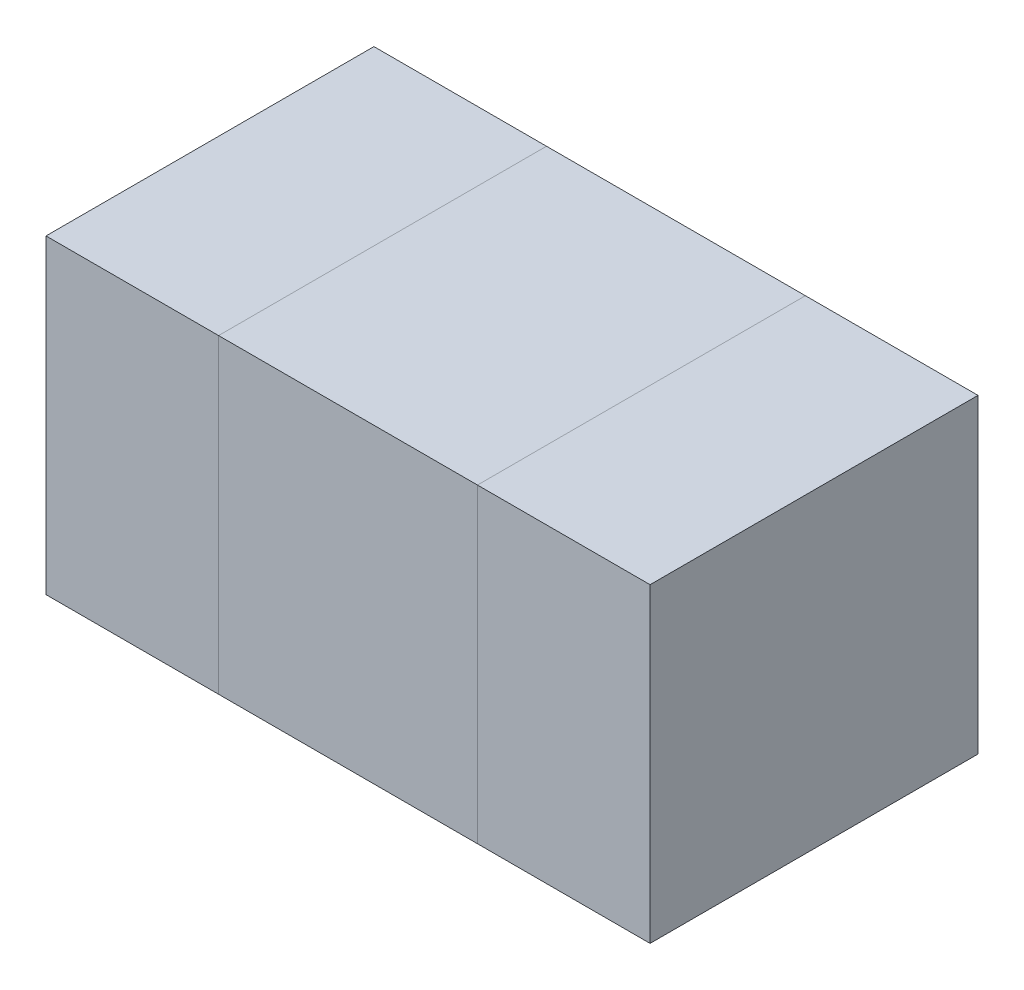
ISO-10303-21;
HEADER;
FILE_DESCRIPTION(('STEP AP214'),'2;1');
FILE_NAME('part.step','',(''),(''),'','','');
FILE_SCHEMA(('AUTOMOTIVE_DESIGN { 1 0 10303 214 1 1 1 1 }'));
ENDSEC;
DATA;
#1=APPLICATION_CONTEXT('core data for automotive mechanical design processes');
#2=APPLICATION_PROTOCOL_DEFINITION('international standard','automotive_design',2000,#1);
#3=PRODUCT_CONTEXT('',#1,'mechanical');
#4=PRODUCT('Part','Part','',(#3));
#5=PRODUCT_RELATED_PRODUCT_CATEGORY('part','',(#4));
#6=PRODUCT_DEFINITION_FORMATION('','',#4);
#7=PRODUCT_DEFINITION_CONTEXT('part definition',#1,'design');
#8=PRODUCT_DEFINITION('design','',#6,#7);
#9=PRODUCT_DEFINITION_SHAPE('','',#8);
#10=(LENGTH_UNIT() NAMED_UNIT(*) SI_UNIT(.MILLI.,.METRE.));
#11=(NAMED_UNIT(*) PLANE_ANGLE_UNIT() SI_UNIT($,.RADIAN.));
#12=(NAMED_UNIT(*) SI_UNIT($,.STERADIAN.) SOLID_ANGLE_UNIT());
#13=UNCERTAINTY_MEASURE_WITH_UNIT(LENGTH_MEASURE(1.E-05),#10,'distance_accuracy_value','');
#14=(GEOMETRIC_REPRESENTATION_CONTEXT(3) GLOBAL_UNCERTAINTY_ASSIGNED_CONTEXT((#13)) GLOBAL_UNIT_ASSIGNED_CONTEXT((#10,
#11,#12)) REPRESENTATION_CONTEXT('',''));
#15=CARTESIAN_POINT('',(0.,0.,0.));
#16=DIRECTION('',(0.,0.,1.));
#17=DIRECTION('',(1.,0.,0.));
#18=AXIS2_PLACEMENT_3D('',#15,#16,#17);
#19=CARTESIAN_POINT('',(-0.875,0.9,-0.475));
#20=DIRECTION('',(1.,0.,0.));
#21=DIRECTION('',(0.,0.,-1.));
#22=AXIS2_PLACEMENT_3D('',#19,#20,#21);
#23=PLANE('',#22);
#24=DIRECTION('',(0.,0.,-1.));
#25=VECTOR('',#24,1.);
#26=CARTESIAN_POINT('',(-0.875,0.9,0.475));
#27=LINE('',#26,#25);
#28=CARTESIAN_POINT('',(-0.875,0.9,0.475));
#29=VERTEX_POINT('',#28);
#30=CARTESIAN_POINT('',(-0.875,0.9,-0.475));
#31=VERTEX_POINT('',#30);
#32=EDGE_CURVE('P0_E76',#29,#31,#27,.T.);
#33=ORIENTED_EDGE('',*,*,#32,.T.);
#34=DIRECTION('',(0.,1.,0.));
#35=VECTOR('',#34,1.);
#36=CARTESIAN_POINT('',(-0.875,0.9,-0.475));
#37=LINE('',#36,#35);
#38=CARTESIAN_POINT('',(-0.875,0.,-0.475));
#39=VERTEX_POINT('',#38);
#40=EDGE_CURVE('P0_E58',#31,#39,#37,.F.);
#41=ORIENTED_EDGE('',*,*,#40,.T.);
#42=DIRECTION('',(0.,0.,-1.));
#43=VECTOR('',#42,1.);
#44=CARTESIAN_POINT('',(-0.875,0.,0.475));
#45=LINE('',#44,#43);
#46=CARTESIAN_POINT('',(-0.875,0.,0.475));
#47=VERTEX_POINT('',#46);
#48=EDGE_CURVE('P0_E20',#47,#39,#45,.T.);
#49=ORIENTED_EDGE('',*,*,#48,.F.);
#50=DIRECTION('',(0.,1.,0.));
#51=VECTOR('',#50,1.);
#52=CARTESIAN_POINT('',(-0.875,0.9,0.475));
#53=LINE('',#52,#51);
#54=EDGE_CURVE('P0_E55',#47,#29,#53,.T.);
#55=ORIENTED_EDGE('',*,*,#54,.T.);
#56=EDGE_LOOP('',(#33,#41,#49,#55));
#57=FACE_BOUND('',#56,.T.);
#58=ADVANCED_FACE('P0_F17',(#57),#23,.F.);
#59=CARTESIAN_POINT('',(-0.375,0.,0.475));
#60=DIRECTION('',(0.,-1.,0.));
#61=DIRECTION('',(0.,0.,-1.));
#62=AXIS2_PLACEMENT_3D('',#59,#60,#61);
#63=PLANE('',#62);
#64=DIRECTION('',(0.,0.,1.));
#65=VECTOR('',#64,1.);
#66=CARTESIAN_POINT('',(-0.375,0.,-0.475));
#67=LINE('',#66,#65);
#68=CARTESIAN_POINT('',(-0.375,0.,-0.475));
#69=VERTEX_POINT('',#68);
#70=CARTESIAN_POINT('',(-0.375,0.,0.475));
#71=VERTEX_POINT('',#70);
#72=EDGE_CURVE('P0_E73',#69,#71,#67,.T.);
#73=ORIENTED_EDGE('',*,*,#72,.T.);
#74=DIRECTION('',(-1.,0.,0.));
#75=VECTOR('',#74,1.);
#76=CARTESIAN_POINT('',(-0.375,0.,0.475));
#77=LINE('',#76,#75);
#78=EDGE_CURVE('P0_E63',#71,#47,#77,.T.);
#79=ORIENTED_EDGE('',*,*,#78,.T.);
#80=ORIENTED_EDGE('',*,*,#48,.T.);
#81=DIRECTION('',(1.,0.,0.));
#82=VECTOR('',#81,1.);
#83=CARTESIAN_POINT('',(-0.375,0.,-0.475));
#84=LINE('',#83,#82);
#85=EDGE_CURVE('P0_E78',#39,#69,#84,.T.);
#86=ORIENTED_EDGE('',*,*,#85,.T.);
#87=EDGE_LOOP('',(#73,#79,#80,#86));
#88=FACE_BOUND('',#87,.T.);
#89=ADVANCED_FACE('P0_F72',(#88),#63,.T.);
#90=CARTESIAN_POINT('',(-0.375,0.9,0.475));
#91=DIRECTION('',(0.,0.,-1.));
#92=DIRECTION('',(-1.,0.,0.));
#93=AXIS2_PLACEMENT_3D('',#90,#91,#92);
#94=PLANE('',#93);
#95=DIRECTION('',(1.,0.,0.));
#96=VECTOR('',#95,1.);
#97=CARTESIAN_POINT('',(-0.375,0.9,0.475));
#98=LINE('',#97,#96);
#99=CARTESIAN_POINT('',(-0.375,0.9,0.475));
#100=VERTEX_POINT('',#99);
#101=EDGE_CURVE('P0_E69',#100,#29,#98,.F.);
#102=ORIENTED_EDGE('',*,*,#101,.T.);
#103=ORIENTED_EDGE('',*,*,#54,.F.);
#104=ORIENTED_EDGE('',*,*,#78,.F.);
#105=DIRECTION('',(0.,1.,0.));
#106=VECTOR('',#105,1.);
#107=CARTESIAN_POINT('',(-0.375,0.9,0.475));
#108=LINE('',#107,#106);
#109=EDGE_CURVE('P0_E83',#71,#100,#108,.T.);
#110=ORIENTED_EDGE('',*,*,#109,.T.);
#111=EDGE_LOOP('',(#102,#103,#104,#110));
#112=FACE_BOUND('',#111,.T.);
#113=ADVANCED_FACE('P0_F66',(#112),#94,.F.);
#114=CARTESIAN_POINT('',(-0.375,0.9,0.475));
#115=DIRECTION('',(0.,-1.,0.));
#116=DIRECTION('',(0.,0.,-1.));
#117=AXIS2_PLACEMENT_3D('',#114,#115,#116);
#118=PLANE('',#117);
#119=ORIENTED_EDGE('',*,*,#32,.F.);
#120=ORIENTED_EDGE('',*,*,#101,.F.);
#121=DIRECTION('',(0.,0.,1.));
#122=VECTOR('',#121,1.);
#123=CARTESIAN_POINT('',(-0.375,0.9,-0.475));
#124=LINE('',#123,#122);
#125=CARTESIAN_POINT('',(-0.375,0.9,-0.475));
#126=VERTEX_POINT('',#125);
#127=EDGE_CURVE('P0_E26',#100,#126,#124,.F.);
#128=ORIENTED_EDGE('',*,*,#127,.T.);
#129=DIRECTION('',(1.,0.,0.));
#130=VECTOR('',#129,1.);
#131=CARTESIAN_POINT('',(-0.375,0.9,-0.475));
#132=LINE('',#131,#130);
#133=EDGE_CURVE('P0_E34',#126,#31,#132,.F.);
#134=ORIENTED_EDGE('',*,*,#133,.T.);
#135=EDGE_LOOP('',(#119,#120,#128,#134));
#136=FACE_BOUND('',#135,.T.);
#137=ADVANCED_FACE('P0_F88',(#136),#118,.F.);
#138=CARTESIAN_POINT('',(-0.375,0.9,-0.475));
#139=DIRECTION('',(0.,0.,1.));
#140=DIRECTION('',(1.,0.,0.));
#141=AXIS2_PLACEMENT_3D('',#138,#139,#140);
#142=PLANE('',#141);
#143=ORIENTED_EDGE('',*,*,#133,.F.);
#144=DIRECTION('',(0.,1.,0.));
#145=VECTOR('',#144,1.);
#146=CARTESIAN_POINT('',(-0.375,0.9,-0.475));
#147=LINE('',#146,#145);
#148=EDGE_CURVE('P0_E11',#126,#69,#147,.F.);
#149=ORIENTED_EDGE('',*,*,#148,.T.);
#150=ORIENTED_EDGE('',*,*,#85,.F.);
#151=ORIENTED_EDGE('',*,*,#40,.F.);
#152=EDGE_LOOP('',(#143,#149,#150,#151));
#153=FACE_BOUND('',#152,.T.);
#154=ADVANCED_FACE('P0_F91',(#153),#142,.F.);
#155=CARTESIAN_POINT('',(-0.375,0.9,-0.475));
#156=DIRECTION('',(-1.,0.,0.));
#157=DIRECTION('',(0.,0.,1.));
#158=AXIS2_PLACEMENT_3D('',#155,#156,#157);
#159=PLANE('',#158);
#160=ORIENTED_EDGE('',*,*,#127,.F.);
#161=ORIENTED_EDGE('',*,*,#109,.F.);
#162=ORIENTED_EDGE('',*,*,#72,.F.);
#163=ORIENTED_EDGE('',*,*,#148,.F.);
#164=EDGE_LOOP('',(#160,#161,#162,#163));
#165=FACE_BOUND('',#164,.T.);
#166=ADVANCED_FACE('P0_F90',(#165),#159,.F.);
#167=CLOSED_SHELL('',(#58,#89,#113,#137,#154,#166));
#168=MANIFOLD_SOLID_BREP('P0_B1',#167);
#169=CARTESIAN_POINT('',(0.875,0.9,-0.475));
#170=DIRECTION('',(-1.,0.,0.));
#171=DIRECTION('',(0.,0.,1.));
#172=AXIS2_PLACEMENT_3D('',#169,#170,#171);
#173=PLANE('',#172);
#174=DIRECTION('',(0.,0.,-1.));
#175=VECTOR('',#174,1.);
#176=CARTESIAN_POINT('',(0.875,0.9,-0.475));
#177=LINE('',#176,#175);
#178=CARTESIAN_POINT('',(0.875,0.9,-0.475));
#179=VERTEX_POINT('',#178);
#180=CARTESIAN_POINT('',(0.875,0.9,0.475));
#181=VERTEX_POINT('',#180);
#182=EDGE_CURVE('P1_E76',#179,#181,#177,.F.);
#183=ORIENTED_EDGE('',*,*,#182,.T.);
#184=DIRECTION('',(0.,1.,0.));
#185=VECTOR('',#184,1.);
#186=CARTESIAN_POINT('',(0.875,0.9,0.475));
#187=LINE('',#186,#185);
#188=CARTESIAN_POINT('',(0.875,0.,0.475));
#189=VERTEX_POINT('',#188);
#190=EDGE_CURVE('P1_E58',#181,#189,#187,.F.);
#191=ORIENTED_EDGE('',*,*,#190,.T.);
#192=DIRECTION('',(0.,0.,-1.));
#193=VECTOR('',#192,1.);
#194=CARTESIAN_POINT('',(0.875,0.,-0.475));
#195=LINE('',#194,#193);
#196=CARTESIAN_POINT('',(0.875,0.,-0.475));
#197=VERTEX_POINT('',#196);
#198=EDGE_CURVE('P1_E20',#197,#189,#195,.F.);
#199=ORIENTED_EDGE('',*,*,#198,.F.);
#200=DIRECTION('',(0.,1.,0.));
#201=VECTOR('',#200,1.);
#202=CARTESIAN_POINT('',(0.875,0.9,-0.475));
#203=LINE('',#202,#201);
#204=EDGE_CURVE('P1_E55',#197,#179,#203,.T.);
#205=ORIENTED_EDGE('',*,*,#204,.T.);
#206=EDGE_LOOP('',(#183,#191,#199,#205));
#207=FACE_BOUND('',#206,.T.);
#208=ADVANCED_FACE('P1_F17',(#207),#173,.F.);
#209=CARTESIAN_POINT('',(0.875,0.,-0.475));
#210=DIRECTION('',(0.,-1.,0.));
#211=DIRECTION('',(0.,0.,-1.));
#212=AXIS2_PLACEMENT_3D('',#209,#210,#211);
#213=PLANE('',#212);
#214=DIRECTION('',(1.,0.,0.));
#215=VECTOR('',#214,1.);
#216=CARTESIAN_POINT('',(0.375,0.,-0.475));
#217=LINE('',#216,#215);
#218=CARTESIAN_POINT('',(0.375,0.,-0.475));
#219=VERTEX_POINT('',#218);
#220=EDGE_CURVE('P1_E63',#219,#197,#217,.T.);
#221=ORIENTED_EDGE('',*,*,#220,.T.);
#222=ORIENTED_EDGE('',*,*,#198,.T.);
#223=DIRECTION('',(-1.,0.,0.));
#224=VECTOR('',#223,1.);
#225=CARTESIAN_POINT('',(0.375,0.,0.475));
#226=LINE('',#225,#224);
#227=CARTESIAN_POINT('',(0.375,0.,0.475));
#228=VERTEX_POINT('',#227);
#229=EDGE_CURVE('P1_E78',#189,#228,#226,.T.);
#230=ORIENTED_EDGE('',*,*,#229,.T.);
#231=DIRECTION('',(0.,0.,-1.));
#232=VECTOR('',#231,1.);
#233=CARTESIAN_POINT('',(0.375,0.,-0.475));
#234=LINE('',#233,#232);
#235=EDGE_CURVE('P1_E73',#228,#219,#234,.T.);
#236=ORIENTED_EDGE('',*,*,#235,.T.);
#237=EDGE_LOOP('',(#221,#222,#230,#236));
#238=FACE_BOUND('',#237,.T.);
#239=ADVANCED_FACE('P1_F72',(#238),#213,.T.);
#240=CARTESIAN_POINT('',(0.375,0.9,-0.475));
#241=DIRECTION('',(0.,0.,1.));
#242=DIRECTION('',(1.,0.,0.));
#243=AXIS2_PLACEMENT_3D('',#240,#241,#242);
#244=PLANE('',#243);
#245=DIRECTION('',(1.,0.,0.));
#246=VECTOR('',#245,1.);
#247=CARTESIAN_POINT('',(0.875,0.9,-0.475));
#248=LINE('',#247,#246);
#249=CARTESIAN_POINT('',(0.375,0.9,-0.475));
#250=VERTEX_POINT('',#249);
#251=EDGE_CURVE('P1_E69',#250,#179,#248,.T.);
#252=ORIENTED_EDGE('',*,*,#251,.T.);
#253=ORIENTED_EDGE('',*,*,#204,.F.);
#254=ORIENTED_EDGE('',*,*,#220,.F.);
#255=DIRECTION('',(0.,1.,0.));
#256=VECTOR('',#255,1.);
#257=CARTESIAN_POINT('',(0.375,0.9,-0.475));
#258=LINE('',#257,#256);
#259=EDGE_CURVE('P1_E83',#219,#250,#258,.T.);
#260=ORIENTED_EDGE('',*,*,#259,.T.);
#261=EDGE_LOOP('',(#252,#253,#254,#260));
#262=FACE_BOUND('',#261,.T.);
#263=ADVANCED_FACE('P1_F66',(#262),#244,.F.);
#264=CARTESIAN_POINT('',(0.875,0.9,-0.475));
#265=DIRECTION('',(0.,-1.,0.));
#266=DIRECTION('',(0.,0.,-1.));
#267=AXIS2_PLACEMENT_3D('',#264,#265,#266);
#268=PLANE('',#267);
#269=DIRECTION('',(-1.,0.,0.));
#270=VECTOR('',#269,1.);
#271=CARTESIAN_POINT('',(0.375,0.9,0.475));
#272=LINE('',#271,#270);
#273=CARTESIAN_POINT('',(0.375,0.9,0.475));
#274=VERTEX_POINT('',#273);
#275=EDGE_CURVE('P1_E34',#274,#181,#272,.F.);
#276=ORIENTED_EDGE('',*,*,#275,.T.);
#277=ORIENTED_EDGE('',*,*,#182,.F.);
#278=ORIENTED_EDGE('',*,*,#251,.F.);
#279=DIRECTION('',(0.,0.,-1.));
#280=VECTOR('',#279,1.);
#281=CARTESIAN_POINT('',(0.375,0.9,-0.475));
#282=LINE('',#281,#280);
#283=EDGE_CURVE('P1_E26',#250,#274,#282,.F.);
#284=ORIENTED_EDGE('',*,*,#283,.T.);
#285=EDGE_LOOP('',(#276,#277,#278,#284));
#286=FACE_BOUND('',#285,.T.);
#287=ADVANCED_FACE('P1_F88',(#286),#268,.F.);
#288=CARTESIAN_POINT('',(0.375,0.9,0.475));
#289=DIRECTION('',(0.,0.,-1.));
#290=DIRECTION('',(-1.,0.,0.));
#291=AXIS2_PLACEMENT_3D('',#288,#289,#290);
#292=PLANE('',#291);
#293=ORIENTED_EDGE('',*,*,#275,.F.);
#294=DIRECTION('',(0.,1.,0.));
#295=VECTOR('',#294,1.);
#296=CARTESIAN_POINT('',(0.375,0.9,0.475));
#297=LINE('',#296,#295);
#298=EDGE_CURVE('P1_E11',#274,#228,#297,.F.);
#299=ORIENTED_EDGE('',*,*,#298,.T.);
#300=ORIENTED_EDGE('',*,*,#229,.F.);
#301=ORIENTED_EDGE('',*,*,#190,.F.);
#302=EDGE_LOOP('',(#293,#299,#300,#301));
#303=FACE_BOUND('',#302,.T.);
#304=ADVANCED_FACE('P1_F91',(#303),#292,.F.);
#305=CARTESIAN_POINT('',(0.375,0.9,-0.475));
#306=DIRECTION('',(1.,0.,0.));
#307=DIRECTION('',(0.,0.,-1.));
#308=AXIS2_PLACEMENT_3D('',#305,#306,#307);
#309=PLANE('',#308);
#310=ORIENTED_EDGE('',*,*,#283,.F.);
#311=ORIENTED_EDGE('',*,*,#259,.F.);
#312=ORIENTED_EDGE('',*,*,#235,.F.);
#313=ORIENTED_EDGE('',*,*,#298,.F.);
#314=EDGE_LOOP('',(#310,#311,#312,#313));
#315=FACE_BOUND('',#314,.T.);
#316=ADVANCED_FACE('P1_F90',(#315),#309,.F.);
#317=CLOSED_SHELL('',(#208,#239,#263,#287,#304,#316));
#318=MANIFOLD_SOLID_BREP('P1_B1',#317);
#319=CARTESIAN_POINT('',(-0.375,0.9,0.475));
#320=DIRECTION('',(1.,0.,0.));
#321=DIRECTION('',(0.,0.,-1.));
#322=AXIS2_PLACEMENT_3D('',#319,#320,#321);
#323=PLANE('',#322);
#324=DIRECTION('',(0.,0.,-1.));
#325=VECTOR('',#324,1.);
#326=CARTESIAN_POINT('',(-0.375,0.9,-0.475));
#327=LINE('',#326,#325);
#328=CARTESIAN_POINT('',(-0.375,0.9,0.475));
#329=VERTEX_POINT('',#328);
#330=CARTESIAN_POINT('',(-0.375,0.9,-0.475));
#331=VERTEX_POINT('',#330);
#332=EDGE_CURVE('P2_E76',#329,#331,#327,.T.);
#333=ORIENTED_EDGE('',*,*,#332,.T.);
#334=DIRECTION('',(0.,1.,0.));
#335=VECTOR('',#334,1.);
#336=CARTESIAN_POINT('',(-0.375,0.9,-0.475));
#337=LINE('',#336,#335);
#338=CARTESIAN_POINT('',(-0.375,0.,-0.475));
#339=VERTEX_POINT('',#338);
#340=EDGE_CURVE('P2_E58',#331,#339,#337,.F.);
#341=ORIENTED_EDGE('',*,*,#340,.T.);
#342=DIRECTION('',(0.,0.,-1.));
#343=VECTOR('',#342,1.);
#344=CARTESIAN_POINT('',(-0.375,0.,-0.475));
#345=LINE('',#344,#343);
#346=CARTESIAN_POINT('',(-0.375,0.,0.475));
#347=VERTEX_POINT('',#346);
#348=EDGE_CURVE('P2_E20',#347,#339,#345,.T.);
#349=ORIENTED_EDGE('',*,*,#348,.F.);
#350=DIRECTION('',(0.,1.,0.));
#351=VECTOR('',#350,1.);
#352=CARTESIAN_POINT('',(-0.375,0.9,0.475));
#353=LINE('',#352,#351);
#354=EDGE_CURVE('P2_E55',#347,#329,#353,.T.);
#355=ORIENTED_EDGE('',*,*,#354,.T.);
#356=EDGE_LOOP('',(#333,#341,#349,#355));
#357=FACE_BOUND('',#356,.T.);
#358=ADVANCED_FACE('P2_F17',(#357),#323,.F.);
#359=CARTESIAN_POINT('',(0.375,0.,-0.475));
#360=DIRECTION('',(0.,-1.,0.));
#361=DIRECTION('',(0.,0.,-1.));
#362=AXIS2_PLACEMENT_3D('',#359,#360,#361);
#363=PLANE('',#362);
#364=DIRECTION('',(0.,0.,1.));
#365=VECTOR('',#364,1.);
#366=CARTESIAN_POINT('',(0.375,0.,0.475));
#367=LINE('',#366,#365);
#368=CARTESIAN_POINT('',(0.375,0.,-0.475));
#369=VERTEX_POINT('',#368);
#370=CARTESIAN_POINT('',(0.375,0.,0.475));
#371=VERTEX_POINT('',#370);
#372=EDGE_CURVE('P2_E73',#369,#371,#367,.T.);
#373=ORIENTED_EDGE('',*,*,#372,.T.);
#374=DIRECTION('',(-1.,0.,0.));
#375=VECTOR('',#374,1.);
#376=CARTESIAN_POINT('',(-0.375,0.,0.475));
#377=LINE('',#376,#375);
#378=EDGE_CURVE('P2_E63',#371,#347,#377,.T.);
#379=ORIENTED_EDGE('',*,*,#378,.T.);
#380=ORIENTED_EDGE('',*,*,#348,.T.);
#381=DIRECTION('',(1.,0.,0.));
#382=VECTOR('',#381,1.);
#383=CARTESIAN_POINT('',(-0.375,0.,-0.475));
#384=LINE('',#383,#382);
#385=EDGE_CURVE('P2_E78',#339,#369,#384,.T.);
#386=ORIENTED_EDGE('',*,*,#385,.T.);
#387=EDGE_LOOP('',(#373,#379,#380,#386));
#388=FACE_BOUND('',#387,.T.);
#389=ADVANCED_FACE('P2_F72',(#388),#363,.T.);
#390=CARTESIAN_POINT('',(-0.375,0.9,0.475));
#391=DIRECTION('',(0.,0.,-1.));
#392=DIRECTION('',(-1.,0.,0.));
#393=AXIS2_PLACEMENT_3D('',#390,#391,#392);
#394=PLANE('',#393);
#395=DIRECTION('',(1.,0.,0.));
#396=VECTOR('',#395,1.);
#397=CARTESIAN_POINT('',(0.375,0.9,0.475));
#398=LINE('',#397,#396);
#399=CARTESIAN_POINT('',(0.375,0.9,0.475));
#400=VERTEX_POINT('',#399);
#401=EDGE_CURVE('P2_E69',#400,#329,#398,.F.);
#402=ORIENTED_EDGE('',*,*,#401,.T.);
#403=ORIENTED_EDGE('',*,*,#354,.F.);
#404=ORIENTED_EDGE('',*,*,#378,.F.);
#405=DIRECTION('',(0.,1.,0.));
#406=VECTOR('',#405,1.);
#407=CARTESIAN_POINT('',(0.375,0.9,0.475));
#408=LINE('',#407,#406);
#409=EDGE_CURVE('P2_E83',#371,#400,#408,.T.);
#410=ORIENTED_EDGE('',*,*,#409,.T.);
#411=EDGE_LOOP('',(#402,#403,#404,#410));
#412=FACE_BOUND('',#411,.T.);
#413=ADVANCED_FACE('P2_F66',(#412),#394,.F.);
#414=CARTESIAN_POINT('',(0.375,0.9,-0.475));
#415=DIRECTION('',(0.,-1.,0.));
#416=DIRECTION('',(0.,0.,-1.));
#417=AXIS2_PLACEMENT_3D('',#414,#415,#416);
#418=PLANE('',#417);
#419=ORIENTED_EDGE('',*,*,#332,.F.);
#420=ORIENTED_EDGE('',*,*,#401,.F.);
#421=DIRECTION('',(0.,0.,1.));
#422=VECTOR('',#421,1.);
#423=CARTESIAN_POINT('',(0.375,0.9,0.475));
#424=LINE('',#423,#422);
#425=CARTESIAN_POINT('',(0.375,0.9,-0.475));
#426=VERTEX_POINT('',#425);
#427=EDGE_CURVE('P2_E26',#400,#426,#424,.F.);
#428=ORIENTED_EDGE('',*,*,#427,.T.);
#429=DIRECTION('',(1.,0.,0.));
#430=VECTOR('',#429,1.);
#431=CARTESIAN_POINT('',(-0.375,0.9,-0.475));
#432=LINE('',#431,#430);
#433=EDGE_CURVE('P2_E34',#426,#331,#432,.F.);
#434=ORIENTED_EDGE('',*,*,#433,.T.);
#435=EDGE_LOOP('',(#419,#420,#428,#434));
#436=FACE_BOUND('',#435,.T.);
#437=ADVANCED_FACE('P2_F88',(#436),#418,.F.);
#438=CARTESIAN_POINT('',(-0.375,0.9,-0.475));
#439=DIRECTION('',(0.,0.,1.));
#440=DIRECTION('',(1.,0.,0.));
#441=AXIS2_PLACEMENT_3D('',#438,#439,#440);
#442=PLANE('',#441);
#443=ORIENTED_EDGE('',*,*,#433,.F.);
#444=DIRECTION('',(0.,1.,0.));
#445=VECTOR('',#444,1.);
#446=CARTESIAN_POINT('',(0.375,0.9,-0.475));
#447=LINE('',#446,#445);
#448=EDGE_CURVE('P2_E11',#426,#369,#447,.F.);
#449=ORIENTED_EDGE('',*,*,#448,.T.);
#450=ORIENTED_EDGE('',*,*,#385,.F.);
#451=ORIENTED_EDGE('',*,*,#340,.F.);
#452=EDGE_LOOP('',(#443,#449,#450,#451));
#453=FACE_BOUND('',#452,.T.);
#454=ADVANCED_FACE('P2_F91',(#453),#442,.F.);
#455=CARTESIAN_POINT('',(0.375,0.9,0.475));
#456=DIRECTION('',(-1.,0.,0.));
#457=DIRECTION('',(0.,0.,1.));
#458=AXIS2_PLACEMENT_3D('',#455,#456,#457);
#459=PLANE('',#458);
#460=ORIENTED_EDGE('',*,*,#427,.F.);
#461=ORIENTED_EDGE('',*,*,#409,.F.);
#462=ORIENTED_EDGE('',*,*,#372,.F.);
#463=ORIENTED_EDGE('',*,*,#448,.F.);
#464=EDGE_LOOP('',(#460,#461,#462,#463));
#465=FACE_BOUND('',#464,.T.);
#466=ADVANCED_FACE('P2_F90',(#465),#459,.F.);
#467=CLOSED_SHELL('',(#358,#389,#413,#437,#454,#466));
#468=MANIFOLD_SOLID_BREP('P2_B1',#467);
#469=ADVANCED_BREP_SHAPE_REPRESENTATION('',(#18,#168,#318,#468),#14);
#470=SHAPE_DEFINITION_REPRESENTATION(#9,#469);
ENDSEC;
END-ISO-10303-21;
